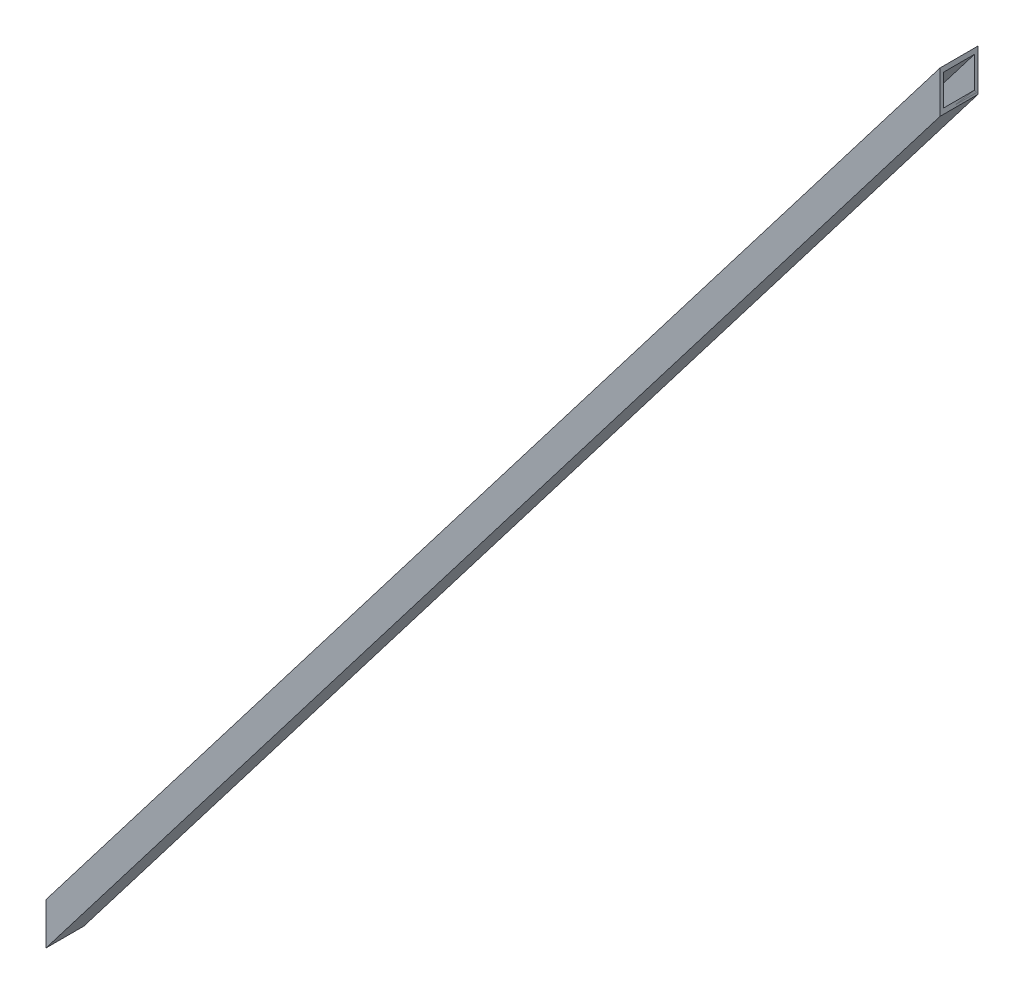
ISO-10303-21;
HEADER;
FILE_DESCRIPTION(('STEP AP214'),'2;1');
FILE_NAME('part.step','',(''),(''),'','','');
FILE_SCHEMA(('AUTOMOTIVE_DESIGN { 1 0 10303 214 1 1 1 1 }'));
ENDSEC;
DATA;
#1=APPLICATION_CONTEXT('core data for automotive mechanical design processes');
#2=APPLICATION_PROTOCOL_DEFINITION('international standard','automotive_design',2000,#1);
#3=PRODUCT_CONTEXT('',#1,'mechanical');
#4=PRODUCT('Part','Part','',(#3));
#5=PRODUCT_RELATED_PRODUCT_CATEGORY('part','',(#4));
#6=PRODUCT_DEFINITION_FORMATION('','',#4);
#7=PRODUCT_DEFINITION_CONTEXT('part definition',#1,'design');
#8=PRODUCT_DEFINITION('design','',#6,#7);
#9=PRODUCT_DEFINITION_SHAPE('','',#8);
#10=(LENGTH_UNIT() NAMED_UNIT(*) SI_UNIT(.MILLI.,.METRE.));
#11=(NAMED_UNIT(*) PLANE_ANGLE_UNIT() SI_UNIT($,.RADIAN.));
#12=(NAMED_UNIT(*) SI_UNIT($,.STERADIAN.) SOLID_ANGLE_UNIT());
#13=UNCERTAINTY_MEASURE_WITH_UNIT(LENGTH_MEASURE(1.E-05),#10,'distance_accuracy_value','');
#14=(GEOMETRIC_REPRESENTATION_CONTEXT(3) GLOBAL_UNCERTAINTY_ASSIGNED_CONTEXT((#13)) GLOBAL_UNIT_ASSIGNED_CONTEXT((#10,
#11,#12)) REPRESENTATION_CONTEXT('',''));
#15=CARTESIAN_POINT('',(0.,0.,0.));
#16=DIRECTION('',(0.,0.,1.));
#17=DIRECTION('',(1.,0.,0.));
#18=AXIS2_PLACEMENT_3D('',#15,#16,#17);
#19=CARTESIAN_POINT('',(-502.053424914183,28.9259895237384,-27.5));
#20=DIRECTION('',(-0.821369965673296,0.570395809495344,0.));
#21=DIRECTION('',(0.,0.,1.));
#22=AXIS2_PLACEMENT_3D('',#19,#20,#21);
#23=PLANE('',#22);
#24=DIRECTION('',(0.,0.,1.));
#25=VECTOR('',#24,1.);
#26=CARTESIAN_POINT('',(-500.,31.8829214001622,0.));
#27=LINE('',#26,#25);
#28=CARTESIAN_POINT('',(-500.,31.8829214001622,-30.2313000567496));
#29=VERTEX_POINT('',#28);
#30=CARTESIAN_POINT('',(-500.,31.8829214001622,0.231300056749522));
#31=VERTEX_POINT('',#30);
#32=EDGE_CURVE('E13',#29,#31,#27,.T.);
#33=ORIENTED_EDGE('',*,*,#32,.T.);
#34=DIRECTION('',(0.55323817471572,0.796662971590637,-0.243424796874917));
#35=VECTOR('',#34,1.);
#36=CARTESIAN_POINT('',(-498.197121324456,34.4790666929451,-0.561966560489669));
#37=LINE('',#36,#35);
#38=CARTESIAN_POINT('',(0.,751.882921400162,-219.768699943251));
#39=VERTEX_POINT('',#38);
#40=EDGE_CURVE('E108',#31,#39,#37,.T.);
#41=ORIENTED_EDGE('',*,*,#40,.T.);
#42=DIRECTION('',(0.,0.,1.));
#43=VECTOR('',#42,1.);
#44=CARTESIAN_POINT('',(0.,751.882921400162,0.));
#45=LINE('',#44,#43);
#46=CARTESIAN_POINT('',(0.,751.882921400162,-250.23130005675));
#47=VERTEX_POINT('',#46);
#48=EDGE_CURVE('E201',#47,#39,#45,.T.);
#49=ORIENTED_EDGE('',*,*,#48,.F.);
#50=DIRECTION('',(0.55323817471572,0.796662971590637,-0.243424796874917));
#51=VECTOR('',#50,1.);
#52=CARTESIAN_POINT('',(-513.318186471965,12.7047328805329,-24.371298009085));
#53=LINE('',#52,#51);
#54=EDGE_CURVE('E197',#29,#47,#53,.T.);
#55=ORIENTED_EDGE('',*,*,#54,.F.);
#56=EDGE_LOOP('',(#33,#41,#49,#55));
#57=FACE_BOUND('',#56,.T.);
#58=ADVANCED_FACE('F99',(#57),#23,.T.);
#59=CARTESIAN_POINT('',(-498.993153464335,27.5,-0.211712418943086));
#60=DIRECTION('',(0.402738614266017,0.,0.915315032422766));
#61=DIRECTION('',(0.,-1.,0.));
#62=AXIS2_PLACEMENT_3D('',#59,#60,#61);
#63=PLANE('',#62);
#64=DIRECTION('',(0.,-1.,0.));
#65=VECTOR('',#64,1.);
#66=CARTESIAN_POINT('',(-500.,0.,0.231300056749522));
#67=LINE('',#66,#65);
#68=CARTESIAN_POINT('',(-500.,-1.88292140016225,0.231300056749522));
#69=VERTEX_POINT('',#68);
#70=EDGE_CURVE('E196',#31,#69,#67,.T.);
#71=ORIENTED_EDGE('',*,*,#70,.T.);
#72=DIRECTION('',(0.55323817471572,0.796662971590637,-0.243424796874917));
#73=VECTOR('',#72,1.);
#74=CARTESIAN_POINT('',(-486.681813528035,17.2952671194671,-5.62870199091499));
#75=LINE('',#74,#73);
#76=CARTESIAN_POINT('',(0.,718.117078599838,-219.768699943251));
#77=VERTEX_POINT('',#76);
#78=EDGE_CURVE('E202',#69,#77,#75,.T.);
#79=ORIENTED_EDGE('',*,*,#78,.T.);
#80=DIRECTION('',(0.,-1.,0.));
#81=VECTOR('',#80,1.);
#82=CARTESIAN_POINT('',(0.,0.,-219.768699943251));
#83=LINE('',#82,#81);
#84=EDGE_CURVE('E216',#39,#77,#83,.T.);
#85=ORIENTED_EDGE('',*,*,#84,.F.);
#86=ORIENTED_EDGE('',*,*,#40,.F.);
#87=EDGE_LOOP('',(#71,#79,#85,#86));
#88=FACE_BOUND('',#87,.T.);
#89=ADVANCED_FACE('F230',(#88),#63,.T.);
#90=CARTESIAN_POINT('',(-497.946575085817,1.07401047626164,-2.5));
#91=DIRECTION('',(0.821369965673296,-0.570395809495344,0.));
#92=DIRECTION('',(0.,0.,-1.));
#93=AXIS2_PLACEMENT_3D('',#90,#91,#92);
#94=PLANE('',#93);
#95=DIRECTION('',(0.,0.,-1.));
#96=VECTOR('',#95,1.);
#97=CARTESIAN_POINT('',(-500.,-1.88292140016225,0.));
#98=LINE('',#97,#96);
#99=CARTESIAN_POINT('',(-500.,-1.88292140016225,-30.2313000567496));
#100=VERTEX_POINT('',#99);
#101=EDGE_CURVE('E205',#69,#100,#98,.T.);
#102=ORIENTED_EDGE('',*,*,#101,.T.);
#103=DIRECTION('',(0.55323817471572,0.796662971590637,-0.243424796874917));
#104=VECTOR('',#103,1.);
#105=CARTESIAN_POINT('',(-501.802878675544,-4.47906669294508,-29.4380334395104));
#106=LINE('',#105,#104);
#107=CARTESIAN_POINT('',(0.,718.117078599838,-250.23130005675));
#108=VERTEX_POINT('',#107);
#109=EDGE_CURVE('E206',#100,#108,#106,.T.);
#110=ORIENTED_EDGE('',*,*,#109,.T.);
#111=DIRECTION('',(0.,0.,-1.));
#112=VECTOR('',#111,1.);
#113=CARTESIAN_POINT('',(0.,718.117078599838,0.));
#114=LINE('',#113,#112);
#115=EDGE_CURVE('E218',#77,#108,#114,.T.);
#116=ORIENTED_EDGE('',*,*,#115,.F.);
#117=ORIENTED_EDGE('',*,*,#78,.F.);
#118=EDGE_LOOP('',(#102,#110,#116,#117));
#119=FACE_BOUND('',#118,.T.);
#120=ADVANCED_FACE('F233',(#119),#94,.T.);
#121=CARTESIAN_POINT('',(-501.006846535665,2.5,-29.7882875810569));
#122=DIRECTION('',(-0.402738614266017,0.,-0.915315032422766));
#123=DIRECTION('',(0.,1.,0.));
#124=AXIS2_PLACEMENT_3D('',#121,#122,#123);
#125=PLANE('',#124);
#126=DIRECTION('',(0.,1.,0.));
#127=VECTOR('',#126,1.);
#128=CARTESIAN_POINT('',(-500.,0.,-30.2313000567496));
#129=LINE('',#128,#127);
#130=EDGE_CURVE('E200',#100,#29,#129,.T.);
#131=ORIENTED_EDGE('',*,*,#130,.T.);
#132=ORIENTED_EDGE('',*,*,#54,.T.);
#133=DIRECTION('',(0.,1.,0.));
#134=VECTOR('',#133,1.);
#135=CARTESIAN_POINT('',(0.,0.,-250.23130005675));
#136=LINE('',#135,#134);
#137=EDGE_CURVE('E103',#108,#47,#136,.T.);
#138=ORIENTED_EDGE('',*,*,#137,.F.);
#139=ORIENTED_EDGE('',*,*,#109,.F.);
#140=EDGE_LOOP('',(#131,#132,#138,#139));
#141=FACE_BOUND('',#140,.T.);
#142=ADVANCED_FACE('F101',(#141),#125,.T.);
#143=CARTESIAN_POINT('',(-500.,0.,0.));
#144=DIRECTION('',(1.,0.,0.));
#145=DIRECTION('',(0.,0.,-1.));
#146=AXIS2_PLACEMENT_3D('',#143,#144,#145);
#147=PLANE('',#146);
#148=DIRECTION('',(0.,0.,-1.));
#149=VECTOR('',#148,1.);
#150=CARTESIAN_POINT('',(-500.,2.5,-15.));
#151=LINE('',#150,#149);
#152=CARTESIAN_POINT('',(-500.,2.5,-2.5));
#153=VERTEX_POINT('',#152);
#154=CARTESIAN_POINT('',(-500.,2.5,-27.5));
#155=VERTEX_POINT('',#154);
#156=EDGE_CURVE('E183',#153,#155,#151,.T.);
#157=ORIENTED_EDGE('',*,*,#156,.T.);
#158=DIRECTION('',(0.,1.,0.));
#159=VECTOR('',#158,1.);
#160=CARTESIAN_POINT('',(-500.,15.,-27.5));
#161=LINE('',#160,#159);
#162=CARTESIAN_POINT('',(-500.,27.5,-27.5));
#163=VERTEX_POINT('',#162);
#164=EDGE_CURVE('E175',#155,#163,#161,.T.);
#165=ORIENTED_EDGE('',*,*,#164,.T.);
#166=DIRECTION('',(0.,0.,1.));
#167=VECTOR('',#166,1.);
#168=CARTESIAN_POINT('',(-500.,27.5,-15.));
#169=LINE('',#168,#167);
#170=CARTESIAN_POINT('',(-500.,27.5,-2.5));
#171=VERTEX_POINT('',#170);
#172=EDGE_CURVE('E165',#163,#171,#169,.T.);
#173=ORIENTED_EDGE('',*,*,#172,.T.);
#174=DIRECTION('',(0.,-1.,0.));
#175=VECTOR('',#174,1.);
#176=CARTESIAN_POINT('',(-500.,15.,-2.5));
#177=LINE('',#176,#175);
#178=EDGE_CURVE('E348',#171,#153,#177,.T.);
#179=ORIENTED_EDGE('',*,*,#178,.T.);
#180=EDGE_LOOP('',(#157,#165,#173,#179));
#181=FACE_BOUND('',#180,.T.);
#182=ORIENTED_EDGE('',*,*,#130,.F.);
#183=ORIENTED_EDGE('',*,*,#101,.F.);
#184=ORIENTED_EDGE('',*,*,#70,.F.);
#185=ORIENTED_EDGE('',*,*,#32,.F.);
#186=EDGE_LOOP('',(#182,#183,#184,#185));
#187=FACE_BOUND('',#186,.T.);
#188=ADVANCED_FACE('F181',(#181,#187),#147,.F.);
#189=CARTESIAN_POINT('',(0.,0.,0.));
#190=DIRECTION('',(1.,0.,0.));
#191=DIRECTION('',(0.,0.,-1.));
#192=AXIS2_PLACEMENT_3D('',#189,#190,#191);
#193=PLANE('',#192);
#194=DIRECTION('',(0.,0.,1.));
#195=VECTOR('',#194,1.);
#196=CARTESIAN_POINT('',(0.,747.5,-235.));
#197=LINE('',#196,#195);
#198=CARTESIAN_POINT('',(0.,747.5,-247.5));
#199=VERTEX_POINT('',#198);
#200=CARTESIAN_POINT('',(0.,747.5,-222.5));
#201=VERTEX_POINT('',#200);
#202=EDGE_CURVE('E178',#199,#201,#197,.T.);
#203=ORIENTED_EDGE('',*,*,#202,.F.);
#204=DIRECTION('',(0.,1.,0.));
#205=VECTOR('',#204,1.);
#206=CARTESIAN_POINT('',(0.,735.,-247.5));
#207=LINE('',#206,#205);
#208=CARTESIAN_POINT('',(0.,722.5,-247.5));
#209=VERTEX_POINT('',#208);
#210=EDGE_CURVE('E177',#209,#199,#207,.T.);
#211=ORIENTED_EDGE('',*,*,#210,.F.);
#212=DIRECTION('',(0.,0.,-1.));
#213=VECTOR('',#212,1.);
#214=CARTESIAN_POINT('',(0.,722.5,-235.));
#215=LINE('',#214,#213);
#216=CARTESIAN_POINT('',(0.,722.5,-222.5));
#217=VERTEX_POINT('',#216);
#218=EDGE_CURVE('E191',#217,#209,#215,.T.);
#219=ORIENTED_EDGE('',*,*,#218,.F.);
#220=DIRECTION('',(0.,-1.,0.));
#221=VECTOR('',#220,1.);
#222=CARTESIAN_POINT('',(0.,735.,-222.5));
#223=LINE('',#222,#221);
#224=EDGE_CURVE('E189',#201,#217,#223,.T.);
#225=ORIENTED_EDGE('',*,*,#224,.F.);
#226=EDGE_LOOP('',(#203,#211,#219,#225));
#227=FACE_BOUND('',#226,.T.);
#228=ORIENTED_EDGE('',*,*,#48,.T.);
#229=ORIENTED_EDGE('',*,*,#84,.T.);
#230=ORIENTED_EDGE('',*,*,#115,.T.);
#231=ORIENTED_EDGE('',*,*,#137,.T.);
#232=EDGE_LOOP('',(#228,#229,#230,#231));
#233=FACE_BOUND('',#232,.T.);
#234=ADVANCED_FACE('F222',(#227,#233),#193,.T.);
#235=CARTESIAN_POINT('',(-500.,27.5,-27.5));
#236=DIRECTION('',(-0.821369965673296,0.570395809495344,0.));
#237=DIRECTION('',(0.,0.,1.));
#238=AXIS2_PLACEMENT_3D('',#235,#236,#237);
#239=PLANE('',#238);
#240=ORIENTED_EDGE('',*,*,#172,.F.);
#241=DIRECTION('',(0.55323817471572,0.796662971590637,-0.243424796874917));
#242=VECTOR('',#241,1.);
#243=CARTESIAN_POINT('',(-250.,387.5,-137.5));
#244=LINE('',#243,#242);
#245=EDGE_CURVE('E168',#163,#199,#244,.T.);
#246=ORIENTED_EDGE('',*,*,#245,.T.);
#247=ORIENTED_EDGE('',*,*,#202,.T.);
#248=DIRECTION('',(0.55323817471572,0.796662971590637,-0.243424796874917));
#249=VECTOR('',#248,1.);
#250=CARTESIAN_POINT('',(-250.,387.5,-112.5));
#251=LINE('',#250,#249);
#252=EDGE_CURVE('E116',#171,#201,#251,.T.);
#253=ORIENTED_EDGE('',*,*,#252,.F.);
#254=EDGE_LOOP('',(#240,#246,#247,#253));
#255=FACE_BOUND('',#254,.T.);
#256=ADVANCED_FACE('F167',(#255),#239,.F.);
#257=CARTESIAN_POINT('',(-500.,27.5,-2.5));
#258=DIRECTION('',(0.402738614266017,0.,0.915315032422766));
#259=DIRECTION('',(0.,-1.,0.));
#260=AXIS2_PLACEMENT_3D('',#257,#258,#259);
#261=PLANE('',#260);
#262=ORIENTED_EDGE('',*,*,#178,.F.);
#263=ORIENTED_EDGE('',*,*,#252,.T.);
#264=ORIENTED_EDGE('',*,*,#224,.T.);
#265=DIRECTION('',(0.55323817471572,0.796662971590637,-0.243424796874917));
#266=VECTOR('',#265,1.);
#267=CARTESIAN_POINT('',(-250.,362.5,-112.5));
#268=LINE('',#267,#266);
#269=EDGE_CURVE('E351',#153,#217,#268,.T.);
#270=ORIENTED_EDGE('',*,*,#269,.F.);
#271=EDGE_LOOP('',(#262,#263,#264,#270));
#272=FACE_BOUND('',#271,.T.);
#273=ADVANCED_FACE('F255',(#272),#261,.F.);
#274=CARTESIAN_POINT('',(-500.,2.5,-2.5));
#275=DIRECTION('',(0.821369965673296,-0.570395809495344,0.));
#276=DIRECTION('',(0.,0.,-1.));
#277=AXIS2_PLACEMENT_3D('',#274,#275,#276);
#278=PLANE('',#277);
#279=ORIENTED_EDGE('',*,*,#156,.F.);
#280=ORIENTED_EDGE('',*,*,#269,.T.);
#281=ORIENTED_EDGE('',*,*,#218,.T.);
#282=DIRECTION('',(0.55323817471572,0.796662971590637,-0.243424796874917));
#283=VECTOR('',#282,1.);
#284=CARTESIAN_POINT('',(-250.,362.5,-137.5));
#285=LINE('',#284,#283);
#286=EDGE_CURVE('E124',#155,#209,#285,.T.);
#287=ORIENTED_EDGE('',*,*,#286,.F.);
#288=EDGE_LOOP('',(#279,#280,#281,#287));
#289=FACE_BOUND('',#288,.T.);
#290=ADVANCED_FACE('F252',(#289),#278,.F.);
#291=CARTESIAN_POINT('',(-500.,2.5,-27.5));
#292=DIRECTION('',(-0.402738614266017,0.,-0.915315032422766));
#293=DIRECTION('',(0.,1.,0.));
#294=AXIS2_PLACEMENT_3D('',#291,#292,#293);
#295=PLANE('',#294);
#296=ORIENTED_EDGE('',*,*,#164,.F.);
#297=ORIENTED_EDGE('',*,*,#286,.T.);
#298=ORIENTED_EDGE('',*,*,#210,.T.);
#299=ORIENTED_EDGE('',*,*,#245,.F.);
#300=EDGE_LOOP('',(#296,#297,#298,#299));
#301=FACE_BOUND('',#300,.T.);
#302=ADVANCED_FACE('F174',(#301),#295,.F.);
#303=CLOSED_SHELL('',(#58,#89,#120,#142,#188,#234,#256,#273,#290,#302));
#304=MANIFOLD_SOLID_BREP('B2',#303);
#305=CARTESIAN_POINT('',(32.949157384179,797.446786633218,-234.497629249039));
#306=DIRECTION('',(0.821369965673296,-0.570395809495344,0.));
#307=DIRECTION('',(0.570395809495344,0.821369965673296,0.));
#308=AXIS2_PLACEMENT_3D('',#305,#306,#307);
#309=PLANE('',#308);
#310=DIRECTION('',(0.,0.,1.));
#311=VECTOR('',#310,1.);
#312=CARTESIAN_POINT('',(0.,750.,-234.497629249039));
#313=LINE('',#312,#311);
#314=CARTESIAN_POINT('',(0.,750.,-250.));
#315=VERTEX_POINT('',#314);
#316=CARTESIAN_POINT('',(0.,750.,-220.));
#317=VERTEX_POINT('',#316);
#318=EDGE_CURVE('E483',#315,#317,#313,.T.);
#319=ORIENTED_EDGE('',*,*,#318,.F.);
#320=DIRECTION('',(-0.55323817471572,-0.796662971590637,0.243424796874917));
#321=VECTOR('',#320,1.);
#322=CARTESIAN_POINT('',(32.949157384179,797.446786633218,-264.497629249039));
#323=LINE('',#322,#321);
#324=CARTESIAN_POINT('',(-500.,30.,-30.));
#325=VERTEX_POINT('',#324);
#326=EDGE_CURVE('E374',#315,#325,#323,.T.);
#327=ORIENTED_EDGE('',*,*,#326,.T.);
#328=DIRECTION('',(0.,0.,1.));
#329=VECTOR('',#328,1.);
#330=CARTESIAN_POINT('',(-500.,30.,0.));
#331=LINE('',#330,#329);
#332=CARTESIAN_POINT('',(-500.,30.,0.));
#333=VERTEX_POINT('',#332);
#334=EDGE_CURVE('E457',#325,#333,#331,.T.);
#335=ORIENTED_EDGE('',*,*,#334,.T.);
#336=DIRECTION('',(-0.55323817471572,-0.796662971590637,0.243424796874917));
#337=VECTOR('',#336,1.);
#338=CARTESIAN_POINT('',(32.949157384179,797.446786633218,-234.497629249039));
#339=LINE('',#338,#337);
#340=EDGE_CURVE('E460',#317,#333,#339,.T.);
#341=ORIENTED_EDGE('',*,*,#340,.F.);
#342=EDGE_LOOP('',(#319,#327,#335,#341));
#343=FACE_BOUND('',#342,.T.);
#344=ADVANCED_FACE('F359',(#343),#309,.F.);
#345=CARTESIAN_POINT('',(32.949157384179,767.446786633218,-264.497629249039));
#346=DIRECTION('',(0.402738614266017,0.,0.915315032422766));
#347=DIRECTION('',(0.915315032422765,0.,-0.402738614266017));
#348=AXIS2_PLACEMENT_3D('',#345,#346,#347);
#349=PLANE('',#348);
#350=DIRECTION('',(0.,1.,0.));
#351=VECTOR('',#350,1.);
#352=CARTESIAN_POINT('',(0.,767.446786633218,-250.));
#353=LINE('',#352,#351);
#354=CARTESIAN_POINT('',(0.,720.,-250.));
#355=VERTEX_POINT('',#354);
#356=EDGE_CURVE('E486',#355,#315,#353,.T.);
#357=ORIENTED_EDGE('',*,*,#356,.F.);
#358=DIRECTION('',(-0.55323817471572,-0.796662971590637,0.243424796874917));
#359=VECTOR('',#358,1.);
#360=CARTESIAN_POINT('',(32.949157384179,767.446786633218,-264.497629249039));
#361=LINE('',#360,#359);
#362=CARTESIAN_POINT('',(-500.,0.,-30.));
#363=VERTEX_POINT('',#362);
#364=EDGE_CURVE('E463',#355,#363,#361,.T.);
#365=ORIENTED_EDGE('',*,*,#364,.T.);
#366=DIRECTION('',(0.,1.,0.));
#367=VECTOR('',#366,1.);
#368=CARTESIAN_POINT('',(-500.,0.,-30.));
#369=LINE('',#368,#367);
#370=EDGE_CURVE('E455',#363,#325,#369,.T.);
#371=ORIENTED_EDGE('',*,*,#370,.T.);
#372=ORIENTED_EDGE('',*,*,#326,.F.);
#373=EDGE_LOOP('',(#357,#365,#371,#372));
#374=FACE_BOUND('',#373,.T.);
#375=ADVANCED_FACE('F485',(#374),#349,.F.);
#376=CARTESIAN_POINT('',(32.949157384179,767.446786633218,-234.497629249039));
#377=DIRECTION('',(-0.821369965673296,0.570395809495344,0.));
#378=DIRECTION('',(-0.570395809495344,-0.821369965673296,0.));
#379=AXIS2_PLACEMENT_3D('',#376,#377,#378);
#380=PLANE('',#379);
#381=DIRECTION('',(0.,0.,-1.));
#382=VECTOR('',#381,1.);
#383=CARTESIAN_POINT('',(0.,720.,-234.497629249039));
#384=LINE('',#383,#382);
#385=CARTESIAN_POINT('',(0.,720.,-220.));
#386=VERTEX_POINT('',#385);
#387=EDGE_CURVE('E471',#386,#355,#384,.T.);
#388=ORIENTED_EDGE('',*,*,#387,.F.);
#389=DIRECTION('',(-0.55323817471572,-0.796662971590637,0.243424796874917));
#390=VECTOR('',#389,1.);
#391=CARTESIAN_POINT('',(32.949157384179,767.446786633218,-234.497629249039));
#392=LINE('',#391,#390);
#393=CARTESIAN_POINT('',(-500.,0.,0.));
#394=VERTEX_POINT('',#393);
#395=EDGE_CURVE('E367',#386,#394,#392,.T.);
#396=ORIENTED_EDGE('',*,*,#395,.T.);
#397=DIRECTION('',(0.,0.,-1.));
#398=VECTOR('',#397,1.);
#399=CARTESIAN_POINT('',(-500.,0.,0.));
#400=LINE('',#399,#398);
#401=EDGE_CURVE('E452',#394,#363,#400,.T.);
#402=ORIENTED_EDGE('',*,*,#401,.T.);
#403=ORIENTED_EDGE('',*,*,#364,.F.);
#404=EDGE_LOOP('',(#388,#396,#402,#403));
#405=FACE_BOUND('',#404,.T.);
#406=ADVANCED_FACE('F467',(#405),#380,.F.);
#407=CARTESIAN_POINT('',(32.949157384179,767.446786633218,-234.497629249039));
#408=DIRECTION('',(-0.402738614266017,0.,-0.915315032422766));
#409=DIRECTION('',(-0.915315032422766,0.,0.402738614266017));
#410=AXIS2_PLACEMENT_3D('',#407,#408,#409);
#411=PLANE('',#410);
#412=DIRECTION('',(0.,-1.,0.));
#413=VECTOR('',#412,1.);
#414=CARTESIAN_POINT('',(0.,767.446786633218,-220.));
#415=LINE('',#414,#413);
#416=EDGE_CURVE('E480',#317,#386,#415,.T.);
#417=ORIENTED_EDGE('',*,*,#416,.F.);
#418=ORIENTED_EDGE('',*,*,#340,.T.);
#419=DIRECTION('',(0.,-1.,0.));
#420=VECTOR('',#419,1.);
#421=CARTESIAN_POINT('',(-500.,0.,0.));
#422=LINE('',#421,#420);
#423=EDGE_CURVE('E449',#333,#394,#422,.T.);
#424=ORIENTED_EDGE('',*,*,#423,.T.);
#425=ORIENTED_EDGE('',*,*,#395,.F.);
#426=EDGE_LOOP('',(#417,#418,#424,#425));
#427=FACE_BOUND('',#426,.T.);
#428=ADVANCED_FACE('F361',(#427),#411,.F.);
#429=CARTESIAN_POINT('',(-500.,0.,0.));
#430=DIRECTION('',(-1.,0.,0.));
#431=DIRECTION('',(0.,0.,1.));
#432=AXIS2_PLACEMENT_3D('',#429,#430,#431);
#433=PLANE('',#432);
#434=ORIENTED_EDGE('',*,*,#423,.F.);
#435=ORIENTED_EDGE('',*,*,#334,.F.);
#436=ORIENTED_EDGE('',*,*,#370,.F.);
#437=ORIENTED_EDGE('',*,*,#401,.F.);
#438=EDGE_LOOP('',(#434,#435,#436,#437));
#439=FACE_BOUND('',#438,.T.);
#440=DIRECTION('',(0.,0.,1.));
#441=VECTOR('',#440,1.);
#442=CARTESIAN_POINT('',(-500.,27.5,-2.5));
#443=LINE('',#442,#441);
#444=CARTESIAN_POINT('',(-500.,27.5,-27.5));
#445=VERTEX_POINT('',#444);
#446=CARTESIAN_POINT('',(-500.,27.4999999999999,-2.5));
#447=VERTEX_POINT('',#446);
#448=EDGE_CURVE('E439',#445,#447,#443,.T.);
#449=ORIENTED_EDGE('',*,*,#448,.T.);
#450=DIRECTION('',(0.,-1.,0.));
#451=VECTOR('',#450,1.);
#452=CARTESIAN_POINT('',(-500.,2.5,-2.5));
#453=LINE('',#452,#451);
#454=CARTESIAN_POINT('',(-500.,2.5,-2.5));
#455=VERTEX_POINT('',#454);
#456=EDGE_CURVE('E488',#447,#455,#453,.T.);
#457=ORIENTED_EDGE('',*,*,#456,.T.);
#458=DIRECTION('',(0.,0.,-1.));
#459=VECTOR('',#458,1.);
#460=CARTESIAN_POINT('',(-500.,2.5,-2.5));
#461=LINE('',#460,#459);
#462=CARTESIAN_POINT('',(-500.,2.5,-27.5));
#463=VERTEX_POINT('',#462);
#464=EDGE_CURVE('E495',#455,#463,#461,.T.);
#465=ORIENTED_EDGE('',*,*,#464,.T.);
#466=DIRECTION('',(0.,1.,0.));
#467=VECTOR('',#466,1.);
#468=CARTESIAN_POINT('',(-500.,2.5,-27.5));
#469=LINE('',#468,#467);
#470=EDGE_CURVE('E498',#463,#445,#469,.T.);
#471=ORIENTED_EDGE('',*,*,#470,.T.);
#472=EDGE_LOOP('',(#449,#457,#465,#471));
#473=FACE_BOUND('',#472,.T.);
#474=ADVANCED_FACE('F477',(#439,#473),#433,.T.);
#475=CARTESIAN_POINT('',(32.949157384179,794.946786633218,-236.997629249039));
#476=DIRECTION('',(0.821369965673296,-0.570395809495344,0.));
#477=DIRECTION('',(0.570395809495344,0.821369965673296,0.));
#478=AXIS2_PLACEMENT_3D('',#475,#476,#477);
#479=PLANE('',#478);
#480=DIRECTION('',(-0.55323817471572,-0.796662971590637,0.243424796874917));
#481=VECTOR('',#480,1.);
#482=CARTESIAN_POINT('',(32.949157384179,794.946786633218,-261.997629249039));
#483=LINE('',#482,#481);
#484=CARTESIAN_POINT('',(0.,747.5,-247.5));
#485=VERTEX_POINT('',#484);
#486=EDGE_CURVE('E431',#485,#445,#483,.T.);
#487=ORIENTED_EDGE('',*,*,#486,.F.);
#488=DIRECTION('',(0.,0.,1.));
#489=VECTOR('',#488,1.);
#490=CARTESIAN_POINT('',(0.,747.5,-236.997629249039));
#491=LINE('',#490,#489);
#492=CARTESIAN_POINT('',(0.,747.5,-222.5));
#493=VERTEX_POINT('',#492);
#494=EDGE_CURVE('E97',#485,#493,#491,.T.);
#495=ORIENTED_EDGE('',*,*,#494,.T.);
#496=DIRECTION('',(-0.55323817471572,-0.796662971590637,0.243424796874917));
#497=VECTOR('',#496,1.);
#498=CARTESIAN_POINT('',(32.949157384179,794.946786633218,-236.997629249039));
#499=LINE('',#498,#497);
#500=EDGE_CURVE('E441',#493,#447,#499,.T.);
#501=ORIENTED_EDGE('',*,*,#500,.T.);
#502=ORIENTED_EDGE('',*,*,#448,.F.);
#503=EDGE_LOOP('',(#487,#495,#501,#502));
#504=FACE_BOUND('',#503,.T.);
#505=ADVANCED_FACE('F437',(#504),#479,.T.);
#506=CARTESIAN_POINT('',(32.949157384179,769.946786633218,-261.997629249039));
#507=DIRECTION('',(0.402738614266017,0.,0.915315032422766));
#508=DIRECTION('',(0.915315032422766,0.,-0.402738614266017));
#509=AXIS2_PLACEMENT_3D('',#506,#507,#508);
#510=PLANE('',#509);
#511=DIRECTION('',(-0.55323817471572,-0.796662971590637,0.243424796874917));
#512=VECTOR('',#511,1.);
#513=CARTESIAN_POINT('',(32.949157384179,769.946786633218,-261.997629249039));
#514=LINE('',#513,#512);
#515=CARTESIAN_POINT('',(0.,722.5,-247.5));
#516=VERTEX_POINT('',#515);
#517=EDGE_CURVE('E433',#516,#463,#514,.T.);
#518=ORIENTED_EDGE('',*,*,#517,.F.);
#519=DIRECTION('',(0.,1.,0.));
#520=VECTOR('',#519,1.);
#521=CARTESIAN_POINT('',(0.,769.946786633218,-247.5));
#522=LINE('',#521,#520);
#523=EDGE_CURVE('E424',#516,#485,#522,.T.);
#524=ORIENTED_EDGE('',*,*,#523,.T.);
#525=ORIENTED_EDGE('',*,*,#486,.T.);
#526=ORIENTED_EDGE('',*,*,#470,.F.);
#527=EDGE_LOOP('',(#518,#524,#525,#526));
#528=FACE_BOUND('',#527,.T.);
#529=ADVANCED_FACE('F429',(#528),#510,.T.);
#530=CARTESIAN_POINT('',(32.949157384179,769.946786633218,-236.997629249039));
#531=DIRECTION('',(-0.821369965673296,0.570395809495344,0.));
#532=DIRECTION('',(-0.570395809495344,-0.821369965673296,0.));
#533=AXIS2_PLACEMENT_3D('',#530,#531,#532);
#534=PLANE('',#533);
#535=DIRECTION('',(-0.55323817471572,-0.796662971590637,0.243424796874917));
#536=VECTOR('',#535,1.);
#537=CARTESIAN_POINT('',(32.949157384179,769.946786633218,-236.997629249039));
#538=LINE('',#537,#536);
#539=CARTESIAN_POINT('',(0.,722.5,-222.5));
#540=VERTEX_POINT('',#539);
#541=EDGE_CURVE('E443',#540,#455,#538,.T.);
#542=ORIENTED_EDGE('',*,*,#541,.F.);
#543=DIRECTION('',(0.,0.,-1.));
#544=VECTOR('',#543,1.);
#545=CARTESIAN_POINT('',(0.,722.5,-236.997629249039));
#546=LINE('',#545,#544);
#547=EDGE_CURVE('E435',#540,#516,#546,.T.);
#548=ORIENTED_EDGE('',*,*,#547,.T.);
#549=ORIENTED_EDGE('',*,*,#517,.T.);
#550=ORIENTED_EDGE('',*,*,#464,.F.);
#551=EDGE_LOOP('',(#542,#548,#549,#550));
#552=FACE_BOUND('',#551,.T.);
#553=ADVANCED_FACE('F503',(#552),#534,.T.);
#554=CARTESIAN_POINT('',(32.949157384179,769.946786633218,-236.997629249039));
#555=DIRECTION('',(-0.402738614266017,0.,-0.915315032422766));
#556=DIRECTION('',(-0.915315032422766,0.,0.402738614266017));
#557=AXIS2_PLACEMENT_3D('',#554,#555,#556);
#558=PLANE('',#557);
#559=ORIENTED_EDGE('',*,*,#500,.F.);
#560=DIRECTION('',(0.,-1.,0.));
#561=VECTOR('',#560,1.);
#562=CARTESIAN_POINT('',(0.,769.946786633218,-222.5));
#563=LINE('',#562,#561);
#564=EDGE_CURVE('E382',#493,#540,#563,.T.);
#565=ORIENTED_EDGE('',*,*,#564,.T.);
#566=ORIENTED_EDGE('',*,*,#541,.T.);
#567=ORIENTED_EDGE('',*,*,#456,.F.);
#568=EDGE_LOOP('',(#559,#565,#566,#567));
#569=FACE_BOUND('',#568,.T.);
#570=ADVANCED_FACE('F507',(#569),#558,.T.);
#571=CARTESIAN_POINT('',(0.,0.,0.));
#572=DIRECTION('',(1.,0.,0.));
#573=DIRECTION('',(0.,0.,-1.));
#574=AXIS2_PLACEMENT_3D('',#571,#572,#573);
#575=PLANE('',#574);
#576=ORIENTED_EDGE('',*,*,#564,.F.);
#577=ORIENTED_EDGE('',*,*,#494,.F.);
#578=ORIENTED_EDGE('',*,*,#523,.F.);
#579=ORIENTED_EDGE('',*,*,#547,.F.);
#580=EDGE_LOOP('',(#576,#577,#578,#579));
#581=FACE_BOUND('',#580,.T.);
#582=ORIENTED_EDGE('',*,*,#318,.T.);
#583=ORIENTED_EDGE('',*,*,#416,.T.);
#584=ORIENTED_EDGE('',*,*,#387,.T.);
#585=ORIENTED_EDGE('',*,*,#356,.T.);
#586=EDGE_LOOP('',(#582,#583,#584,#585));
#587=FACE_BOUND('',#586,.T.);
#588=ADVANCED_FACE('F422',(#581,#587),#575,.T.);
#589=CLOSED_SHELL('',(#344,#375,#406,#428,#474,#505,#529,#553,#570,#588));
#590=MANIFOLD_SOLID_BREP('B7',#589);
#591=ADVANCED_BREP_SHAPE_REPRESENTATION('',(#18,#304,#590),#14);
#592=SHAPE_DEFINITION_REPRESENTATION(#9,#591);
ENDSEC;
END-ISO-10303-21;
